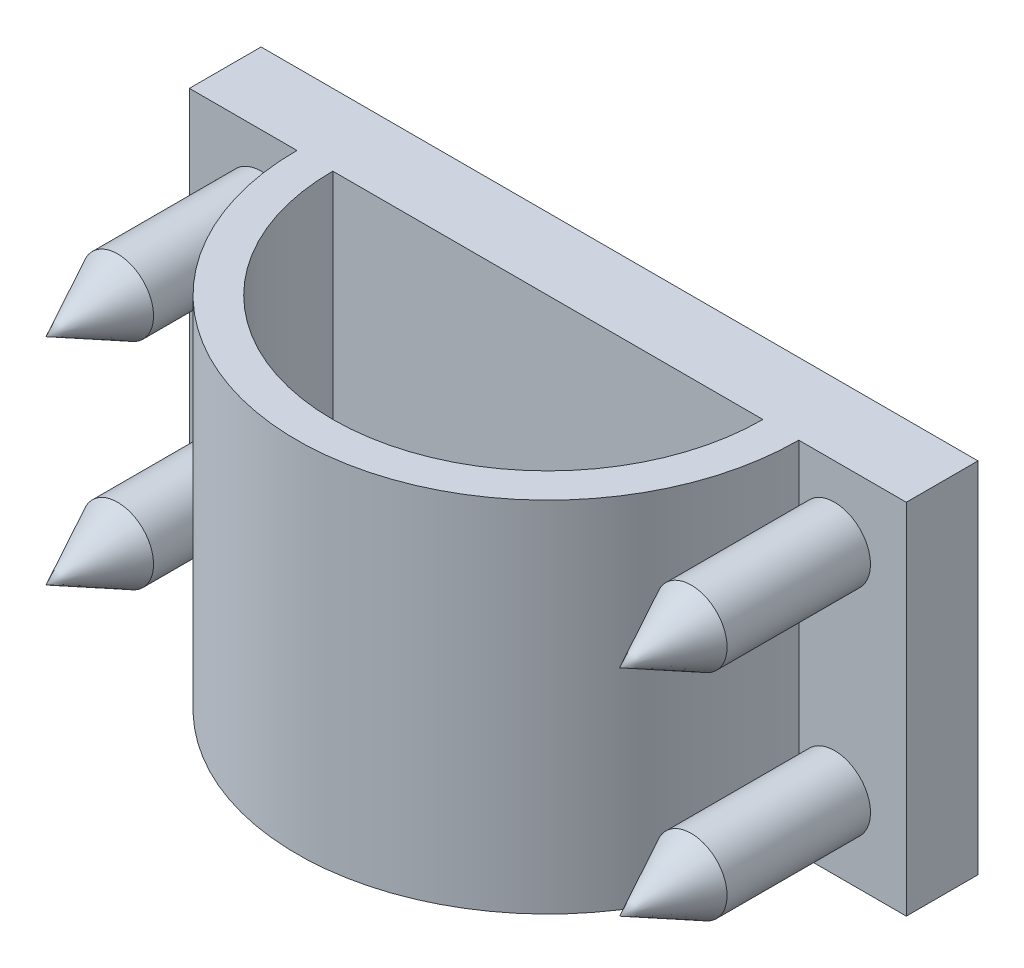
ISO-10303-21;
HEADER;
FILE_DESCRIPTION(('STEP AP214'),'2;1');
FILE_NAME('part.step','',(''),(''),'','','');
FILE_SCHEMA(('AUTOMOTIVE_DESIGN { 1 0 10303 214 1 1 1 1 }'));
ENDSEC;
DATA;
#1=APPLICATION_CONTEXT('core data for automotive mechanical design processes');
#2=APPLICATION_PROTOCOL_DEFINITION('international standard','automotive_design',2000,#1);
#3=PRODUCT_CONTEXT('',#1,'mechanical');
#4=PRODUCT('Part','Part','',(#3));
#5=PRODUCT_RELATED_PRODUCT_CATEGORY('part','',(#4));
#6=PRODUCT_DEFINITION_FORMATION('','',#4);
#7=PRODUCT_DEFINITION_CONTEXT('part definition',#1,'design');
#8=PRODUCT_DEFINITION('design','',#6,#7);
#9=PRODUCT_DEFINITION_SHAPE('','',#8);
#10=(LENGTH_UNIT() NAMED_UNIT(*) SI_UNIT(.MILLI.,.METRE.));
#11=(NAMED_UNIT(*) PLANE_ANGLE_UNIT() SI_UNIT($,.RADIAN.));
#12=(NAMED_UNIT(*) SI_UNIT($,.STERADIAN.) SOLID_ANGLE_UNIT());
#13=UNCERTAINTY_MEASURE_WITH_UNIT(LENGTH_MEASURE(1.E-05),#10,'distance_accuracy_value','');
#14=(GEOMETRIC_REPRESENTATION_CONTEXT(3) GLOBAL_UNCERTAINTY_ASSIGNED_CONTEXT((#13)) GLOBAL_UNIT_ASSIGNED_CONTEXT((#10,
#11,#12)) REPRESENTATION_CONTEXT('',''));
#15=CARTESIAN_POINT('',(0.,0.,0.));
#16=DIRECTION('',(0.,0.,1.));
#17=DIRECTION('',(1.,0.,0.));
#18=AXIS2_PLACEMENT_3D('',#15,#16,#17);
#19=CARTESIAN_POINT('',(0.,0.,10.));
#20=DIRECTION('',(0.,0.,-1.));
#21=DIRECTION('',(-1.,0.,0.));
#22=AXIS2_PLACEMENT_3D('',#19,#20,#21);
#23=PLANE('',#22);
#24=DIRECTION('',(-1.,0.,0.));
#25=VECTOR('',#24,1.);
#26=CARTESIAN_POINT('',(50.,25.,10.));
#27=LINE('',#26,#25);
#28=CARTESIAN_POINT('',(30.,25.,10.));
#29=VERTEX_POINT('',#28);
#30=CARTESIAN_POINT('',(-30.,25.,10.));
#31=VERTEX_POINT('',#30);
#32=EDGE_CURVE('E173',#29,#31,#27,.T.);
#33=ORIENTED_EDGE('',*,*,#32,.T.);
#34=DIRECTION('',(0.,1.,0.));
#35=VECTOR('',#34,1.);
#36=CARTESIAN_POINT('',(-30.,-103.262379212493,10.));
#37=LINE('',#36,#35);
#38=CARTESIAN_POINT('',(-30.,-25.,10.));
#39=VERTEX_POINT('',#38);
#40=EDGE_CURVE('E140',#39,#31,#37,.T.);
#41=ORIENTED_EDGE('',*,*,#40,.F.);
#42=DIRECTION('',(-1.,0.,0.));
#43=VECTOR('',#42,1.);
#44=CARTESIAN_POINT('',(50.,-25.,10.));
#45=LINE('',#44,#43);
#46=CARTESIAN_POINT('',(30.,-25.,10.));
#47=VERTEX_POINT('',#46);
#48=EDGE_CURVE('E136',#47,#39,#45,.T.);
#49=ORIENTED_EDGE('',*,*,#48,.F.);
#50=DIRECTION('',(0.,1.,0.));
#51=VECTOR('',#50,1.);
#52=CARTESIAN_POINT('',(30.,-103.262379212493,10.));
#53=LINE('',#52,#51);
#54=EDGE_CURVE('E141',#47,#29,#53,.T.);
#55=ORIENTED_EDGE('',*,*,#54,.T.);
#56=EDGE_LOOP('',(#33,#41,#49,#55));
#57=FACE_BOUND('',#56,.T.);
#58=ADVANCED_FACE('F43',(#57),#23,.F.);
#59=CARTESIAN_POINT('',(-35.,-25.,10.));
#60=VERTEX_POINT('',#59);
#61=CARTESIAN_POINT('',(-50.,-25.,10.));
#62=VERTEX_POINT('',#61);
#63=EDGE_CURVE('E154',#60,#62,#45,.T.);
#64=ORIENTED_EDGE('',*,*,#63,.F.);
#65=DIRECTION('',(0.,1.,0.));
#66=VECTOR('',#65,1.);
#67=CARTESIAN_POINT('',(-35.,-103.262379212493,10.));
#68=LINE('',#67,#66);
#69=CARTESIAN_POINT('',(-35.,-15.,10.));
#70=VERTEX_POINT('',#69);
#71=EDGE_CURVE('E220',#60,#70,#68,.T.);
#72=ORIENTED_EDGE('',*,*,#71,.T.);
#73=CARTESIAN_POINT('',(-40.,-15.,10.));
#74=DIRECTION('',(0.,0.,-1.));
#75=DIRECTION('',(-1.,0.,0.));
#76=AXIS2_PLACEMENT_3D('',#73,#74,#75);
#77=CIRCLE('',#76,5.);
#78=EDGE_CURVE('E12',#70,#70,#77,.F.);
#79=ORIENTED_EDGE('',*,*,#78,.F.);
#80=CARTESIAN_POINT('',(-35.,15.,10.));
#81=VERTEX_POINT('',#80);
#82=EDGE_CURVE('E307',#70,#81,#68,.T.);
#83=ORIENTED_EDGE('',*,*,#82,.T.);
#84=CARTESIAN_POINT('',(-40.,15.,10.));
#85=DIRECTION('',(0.,0.,-1.));
#86=DIRECTION('',(-1.,0.,0.));
#87=AXIS2_PLACEMENT_3D('',#84,#85,#86);
#88=CIRCLE('',#87,5.);
#89=EDGE_CURVE('E238',#81,#81,#88,.T.);
#90=ORIENTED_EDGE('',*,*,#89,.T.);
#91=CARTESIAN_POINT('',(-35.,25.,10.));
#92=VERTEX_POINT('',#91);
#93=EDGE_CURVE('E299',#81,#92,#68,.T.);
#94=ORIENTED_EDGE('',*,*,#93,.T.);
#95=CARTESIAN_POINT('',(-50.,25.,10.));
#96=VERTEX_POINT('',#95);
#97=EDGE_CURVE('E167',#92,#96,#27,.T.);
#98=ORIENTED_EDGE('',*,*,#97,.T.);
#99=DIRECTION('',(0.,-1.,0.));
#100=VECTOR('',#99,1.);
#101=CARTESIAN_POINT('',(-50.,25.,10.));
#102=LINE('',#101,#100);
#103=EDGE_CURVE('E159',#96,#62,#102,.T.);
#104=ORIENTED_EDGE('',*,*,#103,.T.);
#105=EDGE_LOOP('',(#64,#72,#79,#83,#90,#94,#98,#104));
#106=FACE_BOUND('',#105,.T.);
#107=ADVANCED_FACE('F266',(#106),#23,.F.);
#108=CARTESIAN_POINT('',(50.,25.,10.));
#109=DIRECTION('',(1.,0.,0.));
#110=DIRECTION('',(0.,1.,0.));
#111=AXIS2_PLACEMENT_3D('',#108,#109,#110);
#112=PLANE('',#111);
#113=DIRECTION('',(0.,-1.,0.));
#114=VECTOR('',#113,1.);
#115=CARTESIAN_POINT('',(50.,25.,0.));
#116=LINE('',#115,#114);
#117=CARTESIAN_POINT('',(50.,25.,0.));
#118=VERTEX_POINT('',#117);
#119=CARTESIAN_POINT('',(50.,-25.,0.));
#120=VERTEX_POINT('',#119);
#121=EDGE_CURVE('E174',#118,#120,#116,.T.);
#122=ORIENTED_EDGE('',*,*,#121,.F.);
#123=DIRECTION('',(0.,0.,-1.));
#124=VECTOR('',#123,1.);
#125=CARTESIAN_POINT('',(50.,25.,10.));
#126=LINE('',#125,#124);
#127=CARTESIAN_POINT('',(50.,25.,10.));
#128=VERTEX_POINT('',#127);
#129=EDGE_CURVE('E190',#128,#118,#126,.T.);
#130=ORIENTED_EDGE('',*,*,#129,.F.);
#131=DIRECTION('',(0.,-1.,0.));
#132=VECTOR('',#131,1.);
#133=CARTESIAN_POINT('',(50.,25.,10.));
#134=LINE('',#133,#132);
#135=CARTESIAN_POINT('',(50.,-25.,10.));
#136=VERTEX_POINT('',#135);
#137=EDGE_CURVE('E160',#128,#136,#134,.T.);
#138=ORIENTED_EDGE('',*,*,#137,.T.);
#139=DIRECTION('',(0.,0.,-1.));
#140=VECTOR('',#139,1.);
#141=CARTESIAN_POINT('',(50.,-25.,10.));
#142=LINE('',#141,#140);
#143=EDGE_CURVE('E172',#136,#120,#142,.T.);
#144=ORIENTED_EDGE('',*,*,#143,.T.);
#145=EDGE_LOOP('',(#122,#130,#138,#144));
#146=FACE_BOUND('',#145,.T.);
#147=ADVANCED_FACE('F45',(#146),#112,.T.);
#148=CARTESIAN_POINT('',(50.,25.,10.));
#149=DIRECTION('',(0.,-1.,0.));
#150=DIRECTION('',(1.,0.,0.));
#151=AXIS2_PLACEMENT_3D('',#148,#149,#150);
#152=PLANE('',#151);
#153=ORIENTED_EDGE('',*,*,#97,.F.);
#154=CARTESIAN_POINT('',(0.,25.,10.));
#155=DIRECTION('',(0.,1.,0.));
#156=DIRECTION('',(-1.,0.,0.));
#157=AXIS2_PLACEMENT_3D('',#154,#155,#156);
#158=CIRCLE('',#157,35.);
#159=CARTESIAN_POINT('',(35.,25.,10.));
#160=VERTEX_POINT('',#159);
#161=EDGE_CURVE('E66',#92,#160,#158,.T.);
#162=ORIENTED_EDGE('',*,*,#161,.T.);
#163=EDGE_CURVE('E168',#128,#160,#27,.T.);
#164=ORIENTED_EDGE('',*,*,#163,.F.);
#165=ORIENTED_EDGE('',*,*,#129,.T.);
#166=DIRECTION('',(-1.,0.,0.));
#167=VECTOR('',#166,1.);
#168=CARTESIAN_POINT('',(50.,25.,0.));
#169=LINE('',#168,#167);
#170=CARTESIAN_POINT('',(-50.,25.,0.));
#171=VERTEX_POINT('',#170);
#172=EDGE_CURVE('E187',#118,#171,#169,.T.);
#173=ORIENTED_EDGE('',*,*,#172,.T.);
#174=DIRECTION('',(0.,0.,-1.));
#175=VECTOR('',#174,1.);
#176=CARTESIAN_POINT('',(-50.,25.,10.));
#177=LINE('',#176,#175);
#178=EDGE_CURVE('E193',#96,#171,#177,.T.);
#179=ORIENTED_EDGE('',*,*,#178,.F.);
#180=EDGE_LOOP('',(#153,#162,#164,#165,#173,#179));
#181=FACE_BOUND('',#180,.T.);
#182=CARTESIAN_POINT('',(0.,25.,10.));
#183=DIRECTION('',(0.,-1.,0.));
#184=DIRECTION('',(-1.,0.,0.));
#185=AXIS2_PLACEMENT_3D('',#182,#183,#184);
#186=CIRCLE('',#185,30.);
#187=EDGE_CURVE('E146',#29,#31,#186,.T.);
#188=ORIENTED_EDGE('',*,*,#187,.T.);
#189=ORIENTED_EDGE('',*,*,#32,.F.);
#190=EDGE_LOOP('',(#188,#189));
#191=FACE_BOUND('',#190,.T.);
#192=ADVANCED_FACE('F279',(#181,#191),#152,.F.);
#193=CARTESIAN_POINT('',(-50.,25.,10.));
#194=DIRECTION('',(1.,0.,0.));
#195=DIRECTION('',(0.,0.,-1.));
#196=AXIS2_PLACEMENT_3D('',#193,#194,#195);
#197=PLANE('',#196);
#198=DIRECTION('',(0.,-1.,0.));
#199=VECTOR('',#198,1.);
#200=CARTESIAN_POINT('',(-50.,25.,0.));
#201=LINE('',#200,#199);
#202=CARTESIAN_POINT('',(-50.,-25.,0.));
#203=VERTEX_POINT('',#202);
#204=EDGE_CURVE('E183',#171,#203,#201,.T.);
#205=ORIENTED_EDGE('',*,*,#204,.T.);
#206=DIRECTION('',(0.,0.,-1.));
#207=VECTOR('',#206,1.);
#208=CARTESIAN_POINT('',(-50.,-25.,10.));
#209=LINE('',#208,#207);
#210=EDGE_CURVE('E197',#62,#203,#209,.T.);
#211=ORIENTED_EDGE('',*,*,#210,.F.);
#212=ORIENTED_EDGE('',*,*,#103,.F.);
#213=ORIENTED_EDGE('',*,*,#178,.T.);
#214=EDGE_LOOP('',(#205,#211,#212,#213));
#215=FACE_BOUND('',#214,.T.);
#216=ADVANCED_FACE('F275',(#215),#197,.F.);
#217=CARTESIAN_POINT('',(50.,-25.,10.));
#218=DIRECTION('',(0.,-1.,0.));
#219=DIRECTION('',(1.,0.,0.));
#220=AXIS2_PLACEMENT_3D('',#217,#218,#219);
#221=PLANE('',#220);
#222=CARTESIAN_POINT('',(0.,-25.,10.));
#223=DIRECTION('',(0.,-1.,0.));
#224=DIRECTION('',(1.,0.,0.));
#225=AXIS2_PLACEMENT_3D('',#222,#223,#224);
#226=CIRCLE('',#225,30.);
#227=EDGE_CURVE('E131',#47,#39,#226,.T.);
#228=ORIENTED_EDGE('',*,*,#227,.F.);
#229=ORIENTED_EDGE('',*,*,#48,.T.);
#230=EDGE_LOOP('',(#228,#229));
#231=FACE_BOUND('',#230,.T.);
#232=DIRECTION('',(-1.,0.,0.));
#233=VECTOR('',#232,1.);
#234=CARTESIAN_POINT('',(50.,-25.,0.));
#235=LINE('',#234,#233);
#236=EDGE_CURVE('E178',#120,#203,#235,.T.);
#237=ORIENTED_EDGE('',*,*,#236,.F.);
#238=ORIENTED_EDGE('',*,*,#143,.F.);
#239=CARTESIAN_POINT('',(35.,-25.,10.));
#240=VERTEX_POINT('',#239);
#241=EDGE_CURVE('E153',#136,#240,#45,.T.);
#242=ORIENTED_EDGE('',*,*,#241,.T.);
#243=CARTESIAN_POINT('',(0.,-25.,10.));
#244=DIRECTION('',(0.,-1.,0.));
#245=DIRECTION('',(1.,0.,0.));
#246=AXIS2_PLACEMENT_3D('',#243,#244,#245);
#247=CIRCLE('',#246,35.);
#248=EDGE_CURVE('E59',#60,#240,#247,.F.);
#249=ORIENTED_EDGE('',*,*,#248,.F.);
#250=ORIENTED_EDGE('',*,*,#63,.T.);
#251=ORIENTED_EDGE('',*,*,#210,.T.);
#252=EDGE_LOOP('',(#237,#238,#242,#249,#250,#251));
#253=FACE_BOUND('',#252,.T.);
#254=ADVANCED_FACE('F133',(#231,#253),#221,.T.);
#255=ORIENTED_EDGE('',*,*,#163,.T.);
#256=DIRECTION('',(0.,1.,0.));
#257=VECTOR('',#256,1.);
#258=CARTESIAN_POINT('',(35.,-103.262379212493,10.));
#259=LINE('',#258,#257);
#260=CARTESIAN_POINT('',(35.,15.,10.));
#261=VERTEX_POINT('',#260);
#262=EDGE_CURVE('E212',#261,#160,#259,.T.);
#263=ORIENTED_EDGE('',*,*,#262,.F.);
#264=CARTESIAN_POINT('',(40.,15.,10.));
#265=DIRECTION('',(0.,0.,-1.));
#266=DIRECTION('',(-1.,0.,0.));
#267=AXIS2_PLACEMENT_3D('',#264,#265,#266);
#268=CIRCLE('',#267,5.);
#269=EDGE_CURVE('E52',#261,#261,#268,.F.);
#270=ORIENTED_EDGE('',*,*,#269,.F.);
#271=CARTESIAN_POINT('',(35.,-15.,10.));
#272=VERTEX_POINT('',#271);
#273=EDGE_CURVE('E211',#272,#261,#259,.T.);
#274=ORIENTED_EDGE('',*,*,#273,.F.);
#275=CARTESIAN_POINT('',(40.,-15.,10.));
#276=DIRECTION('',(0.,0.,-1.));
#277=DIRECTION('',(1.,0.,0.));
#278=AXIS2_PLACEMENT_3D('',#275,#276,#277);
#279=CIRCLE('',#278,5.);
#280=EDGE_CURVE('E242',#272,#272,#279,.T.);
#281=ORIENTED_EDGE('',*,*,#280,.T.);
#282=EDGE_CURVE('E217',#240,#272,#259,.T.);
#283=ORIENTED_EDGE('',*,*,#282,.F.);
#284=ORIENTED_EDGE('',*,*,#241,.F.);
#285=ORIENTED_EDGE('',*,*,#137,.F.);
#286=EDGE_LOOP('',(#255,#263,#270,#274,#281,#283,#284,#285));
#287=FACE_BOUND('',#286,.T.);
#288=ADVANCED_FACE('F209',(#287),#23,.F.);
#289=CARTESIAN_POINT('',(0.,0.,0.));
#290=DIRECTION('',(0.,0.,-1.));
#291=DIRECTION('',(-1.,0.,0.));
#292=AXIS2_PLACEMENT_3D('',#289,#290,#291);
#293=PLANE('',#292);
#294=ORIENTED_EDGE('',*,*,#121,.T.);
#295=ORIENTED_EDGE('',*,*,#236,.T.);
#296=ORIENTED_EDGE('',*,*,#204,.F.);
#297=ORIENTED_EDGE('',*,*,#172,.F.);
#298=EDGE_LOOP('',(#294,#295,#296,#297));
#299=FACE_BOUND('',#298,.T.);
#300=ADVANCED_FACE('F253',(#299),#293,.T.);
#301=CARTESIAN_POINT('',(40.,15.,30.));
#302=DIRECTION('',(0.,0.,-1.));
#303=DIRECTION('',(-1.,0.,0.));
#304=AXIS2_PLACEMENT_3D('',#301,#302,#303);
#305=CYLINDRICAL_SURFACE('',#304,5.);
#306=CARTESIAN_POINT('',(40.,15.,30.));
#307=DIRECTION('',(0.,0.,1.));
#308=DIRECTION('',(1.,0.,0.));
#309=AXIS2_PLACEMENT_3D('',#306,#307,#308);
#310=CIRCLE('',#309,5.);
#311=CARTESIAN_POINT('',(45.,15.,30.));
#312=VERTEX_POINT('',#311);
#313=EDGE_CURVE('E179',#312,#312,#310,.T.);
#314=ORIENTED_EDGE('',*,*,#313,.F.);
#315=EDGE_LOOP('',(#314));
#316=FACE_BOUND('',#315,.T.);
#317=ORIENTED_EDGE('',*,*,#269,.T.);
#318=EDGE_LOOP('',(#317));
#319=FACE_BOUND('',#318,.T.);
#320=ADVANCED_FACE('F205',(#316,#319),#305,.T.);
#321=CARTESIAN_POINT('',(40.,-15.,30.));
#322=DIRECTION('',(0.,0.,-1.));
#323=DIRECTION('',(-1.,0.,0.));
#324=AXIS2_PLACEMENT_3D('',#321,#322,#323);
#325=CYLINDRICAL_SURFACE('',#324,5.);
#326=CARTESIAN_POINT('',(40.,-15.,30.));
#327=DIRECTION('',(0.,0.,-1.));
#328=DIRECTION('',(1.,0.,0.));
#329=AXIS2_PLACEMENT_3D('',#326,#327,#328);
#330=CIRCLE('',#329,5.);
#331=CARTESIAN_POINT('',(45.,-15.,30.));
#332=VERTEX_POINT('',#331);
#333=EDGE_CURVE('E227',#332,#332,#330,.T.);
#334=ORIENTED_EDGE('',*,*,#333,.T.);
#335=EDGE_LOOP('',(#334));
#336=FACE_BOUND('',#335,.T.);
#337=ORIENTED_EDGE('',*,*,#280,.F.);
#338=EDGE_LOOP('',(#337));
#339=FACE_BOUND('',#338,.T.);
#340=ADVANCED_FACE('F252',(#336,#339),#325,.T.);
#341=CARTESIAN_POINT('',(-40.,15.,30.));
#342=DIRECTION('',(0.,0.,-1.));
#343=DIRECTION('',(-1.,0.,0.));
#344=AXIS2_PLACEMENT_3D('',#341,#342,#343);
#345=CYLINDRICAL_SURFACE('',#344,5.);
#346=CARTESIAN_POINT('',(-40.,15.,30.));
#347=DIRECTION('',(0.,0.,-1.));
#348=DIRECTION('',(-1.,0.,0.));
#349=AXIS2_PLACEMENT_3D('',#346,#347,#348);
#350=CIRCLE('',#349,5.);
#351=CARTESIAN_POINT('',(-45.,15.,30.));
#352=VERTEX_POINT('',#351);
#353=EDGE_CURVE('E224',#352,#352,#350,.T.);
#354=ORIENTED_EDGE('',*,*,#353,.T.);
#355=EDGE_LOOP('',(#354));
#356=FACE_BOUND('',#355,.T.);
#357=ORIENTED_EDGE('',*,*,#89,.F.);
#358=EDGE_LOOP('',(#357));
#359=FACE_BOUND('',#358,.T.);
#360=ADVANCED_FACE('F259',(#356,#359),#345,.T.);
#361=CARTESIAN_POINT('',(-40.,-15.,30.));
#362=DIRECTION('',(0.,0.,-1.));
#363=DIRECTION('',(-1.,0.,0.));
#364=AXIS2_PLACEMENT_3D('',#361,#362,#363);
#365=CYLINDRICAL_SURFACE('',#364,5.);
#366=CARTESIAN_POINT('',(-40.,-15.,30.));
#367=DIRECTION('',(0.,0.,1.));
#368=DIRECTION('',(-1.,0.,0.));
#369=AXIS2_PLACEMENT_3D('',#366,#367,#368);
#370=CIRCLE('',#369,5.);
#371=CARTESIAN_POINT('',(-45.,-15.,30.));
#372=VERTEX_POINT('',#371);
#373=EDGE_CURVE('E232',#372,#372,#370,.T.);
#374=ORIENTED_EDGE('',*,*,#373,.F.);
#375=EDGE_LOOP('',(#374));
#376=FACE_BOUND('',#375,.T.);
#377=ORIENTED_EDGE('',*,*,#78,.T.);
#378=EDGE_LOOP('',(#377));
#379=FACE_BOUND('',#378,.T.);
#380=ADVANCED_FACE('F310',(#376,#379),#365,.T.);
#381=CARTESIAN_POINT('',(40.,-15.,40.));
#382=DIRECTION('',(0.,0.,-1.));
#383=DIRECTION('',(-1.,0.,0.));
#384=AXIS2_PLACEMENT_3D('',#381,#382,#383);
#385=CONICAL_SURFACE('',#384,0.,0.463647609000806);
#386=ORIENTED_EDGE('',*,*,#333,.F.);
#387=EDGE_LOOP('',(#386));
#388=FACE_BOUND('',#387,.T.);
#389=CARTESIAN_POINT('',(40.,-15.,40.));
#390=VERTEX_POINT('',#389);
#391=VERTEX_LOOP('',#390);
#392=FACE_BOUND('',#391,.T.);
#393=ADVANCED_FACE('F312',(#388,#392),#385,.T.);
#394=CARTESIAN_POINT('',(40.,15.,40.));
#395=DIRECTION('',(0.,0.,-1.));
#396=DIRECTION('',(-1.,0.,0.));
#397=AXIS2_PLACEMENT_3D('',#394,#395,#396);
#398=CONICAL_SURFACE('',#397,0.,0.463647609000806);
#399=ORIENTED_EDGE('',*,*,#313,.T.);
#400=EDGE_LOOP('',(#399));
#401=FACE_BOUND('',#400,.T.);
#402=CARTESIAN_POINT('',(40.,15.,40.));
#403=VERTEX_POINT('',#402);
#404=VERTEX_LOOP('',#403);
#405=FACE_BOUND('',#404,.T.);
#406=ADVANCED_FACE('F248',(#401,#405),#398,.T.);
#407=CARTESIAN_POINT('',(-40.,-15.,40.));
#408=DIRECTION('',(0.,0.,-1.));
#409=DIRECTION('',(-1.,0.,0.));
#410=AXIS2_PLACEMENT_3D('',#407,#408,#409);
#411=CONICAL_SURFACE('',#410,0.,0.463647609000806);
#412=ORIENTED_EDGE('',*,*,#373,.T.);
#413=EDGE_LOOP('',(#412));
#414=FACE_BOUND('',#413,.T.);
#415=CARTESIAN_POINT('',(-40.,-15.,40.));
#416=VERTEX_POINT('',#415);
#417=VERTEX_LOOP('',#416);
#418=FACE_BOUND('',#417,.T.);
#419=ADVANCED_FACE('F326',(#414,#418),#411,.T.);
#420=CARTESIAN_POINT('',(-40.,15.,40.));
#421=DIRECTION('',(0.,0.,-1.));
#422=DIRECTION('',(-1.,0.,0.));
#423=AXIS2_PLACEMENT_3D('',#420,#421,#422);
#424=CONICAL_SURFACE('',#423,0.,0.463647609000806);
#425=ORIENTED_EDGE('',*,*,#353,.F.);
#426=EDGE_LOOP('',(#425));
#427=FACE_BOUND('',#426,.T.);
#428=CARTESIAN_POINT('',(-40.,15.,40.));
#429=VERTEX_POINT('',#428);
#430=VERTEX_LOOP('',#429);
#431=FACE_BOUND('',#430,.T.);
#432=ADVANCED_FACE('F329',(#427,#431),#424,.T.);
#433=CARTESIAN_POINT('',(0.,-103.262379212493,10.));
#434=DIRECTION('',(0.,1.,0.));
#435=DIRECTION('',(-1.,0.,0.));
#436=AXIS2_PLACEMENT_3D('',#433,#434,#435);
#437=CYLINDRICAL_SURFACE('',#436,30.);
#438=ORIENTED_EDGE('',*,*,#54,.F.);
#439=ORIENTED_EDGE('',*,*,#227,.T.);
#440=ORIENTED_EDGE('',*,*,#40,.T.);
#441=ORIENTED_EDGE('',*,*,#187,.F.);
#442=EDGE_LOOP('',(#438,#439,#440,#441));
#443=FACE_BOUND('',#442,.T.);
#444=ADVANCED_FACE('F144',(#443),#437,.F.);
#445=CARTESIAN_POINT('',(0.,-103.262379212493,10.));
#446=DIRECTION('',(0.,1.,0.));
#447=DIRECTION('',(-1.,0.,0.));
#448=AXIS2_PLACEMENT_3D('',#445,#446,#447);
#449=CYLINDRICAL_SURFACE('',#448,35.);
#450=ORIENTED_EDGE('',*,*,#71,.F.);
#451=ORIENTED_EDGE('',*,*,#248,.T.);
#452=ORIENTED_EDGE('',*,*,#282,.T.);
#453=ORIENTED_EDGE('',*,*,#273,.T.);
#454=ORIENTED_EDGE('',*,*,#262,.T.);
#455=ORIENTED_EDGE('',*,*,#161,.F.);
#456=ORIENTED_EDGE('',*,*,#93,.F.);
#457=ORIENTED_EDGE('',*,*,#82,.F.);
#458=EDGE_LOOP('',(#450,#451,#452,#453,#454,#455,#456,#457));
#459=FACE_BOUND('',#458,.T.);
#460=ADVANCED_FACE('F336',(#459),#449,.T.);
#461=CLOSED_SHELL('',(#58,#107,#147,#192,#216,#254,#288,#300,#320,#340,#360,#380,#393,#406,#419,
#432,#444,#460));
#462=MANIFOLD_SOLID_BREP('B2',#461);
#463=ADVANCED_BREP_SHAPE_REPRESENTATION('',(#18,#462),#14);
#464=SHAPE_DEFINITION_REPRESENTATION(#9,#463);
ENDSEC;
END-ISO-10303-21;
